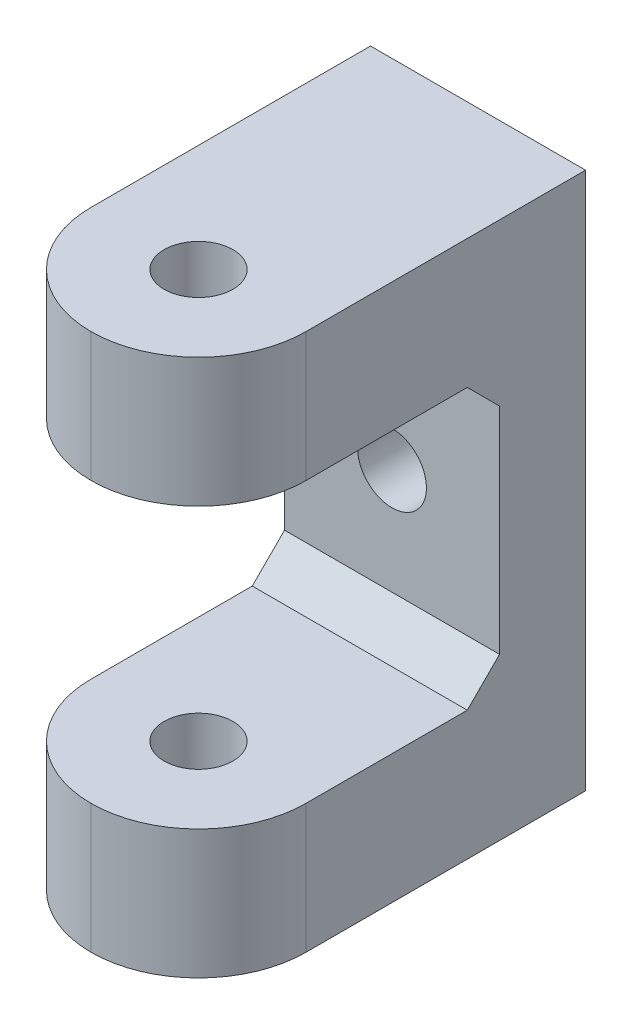
ISO-10303-21;
HEADER;
FILE_DESCRIPTION(('STEP AP214'),'2;1');
FILE_NAME('part.step','',(''),(''),'','','');
FILE_SCHEMA(('AUTOMOTIVE_DESIGN { 1 0 10303 214 1 1 1 1 }'));
ENDSEC;
DATA;
#1=APPLICATION_CONTEXT('core data for automotive mechanical design processes');
#2=APPLICATION_PROTOCOL_DEFINITION('international standard','automotive_design',2000,#1);
#3=PRODUCT_CONTEXT('',#1,'mechanical');
#4=PRODUCT('Part','Part','',(#3));
#5=PRODUCT_RELATED_PRODUCT_CATEGORY('part','',(#4));
#6=PRODUCT_DEFINITION_FORMATION('','',#4);
#7=PRODUCT_DEFINITION_CONTEXT('part definition',#1,'design');
#8=PRODUCT_DEFINITION('design','',#6,#7);
#9=PRODUCT_DEFINITION_SHAPE('','',#8);
#10=(LENGTH_UNIT() NAMED_UNIT(*) SI_UNIT(.MILLI.,.METRE.));
#11=(NAMED_UNIT(*) PLANE_ANGLE_UNIT() SI_UNIT($,.RADIAN.));
#12=(NAMED_UNIT(*) SI_UNIT($,.STERADIAN.) SOLID_ANGLE_UNIT());
#13=UNCERTAINTY_MEASURE_WITH_UNIT(LENGTH_MEASURE(1.E-05),#10,'distance_accuracy_value','');
#14=(GEOMETRIC_REPRESENTATION_CONTEXT(3) GLOBAL_UNCERTAINTY_ASSIGNED_CONTEXT((#13)) GLOBAL_UNIT_ASSIGNED_CONTEXT((#10,
#11,#12)) REPRESENTATION_CONTEXT('',''));
#15=CARTESIAN_POINT('',(0.,0.,0.));
#16=DIRECTION('',(0.,0.,1.));
#17=DIRECTION('',(1.,0.,0.));
#18=AXIS2_PLACEMENT_3D('',#15,#16,#17);
#19=CARTESIAN_POINT('',(0.,0.,1.));
#20=DIRECTION('',(0.,0.,-1.));
#21=DIRECTION('',(-1.,0.,0.));
#22=AXIS2_PLACEMENT_3D('',#19,#20,#21);
#23=PLANE('',#22);
#24=CARTESIAN_POINT('',(5.,12.5,1.));
#25=DIRECTION('',(0.,0.,-1.));
#26=DIRECTION('',(-1.,0.,0.));
#27=AXIS2_PLACEMENT_3D('',#24,#25,#26);
#28=CIRCLE('',#27,1.6);
#29=CARTESIAN_POINT('',(3.4,12.5,1.));
#30=VERTEX_POINT('',#29);
#31=EDGE_CURVE('E430',#30,#30,#28,.F.);
#32=ORIENTED_EDGE('',*,*,#31,.F.);
#33=EDGE_LOOP('',(#32));
#34=FACE_BOUND('',#33,.T.);
#35=DIRECTION('',(0.,1.,0.));
#36=VECTOR('',#35,1.);
#37=CARTESIAN_POINT('',(0.,25.,1.));
#38=LINE('',#37,#36);
#39=CARTESIAN_POINT('',(0.,7.50000000000001,1.));
#40=VERTEX_POINT('',#39);
#41=CARTESIAN_POINT('',(0.,17.5,1.));
#42=VERTEX_POINT('',#41);
#43=EDGE_CURVE('E142',#40,#42,#38,.T.);
#44=ORIENTED_EDGE('',*,*,#43,.F.);
#45=DIRECTION('',(1.,0.,0.));
#46=VECTOR('',#45,1.);
#47=CARTESIAN_POINT('',(10.,7.50000000000001,1.));
#48=LINE('',#47,#46);
#49=CARTESIAN_POINT('',(10.,7.50000000000001,1.));
#50=VERTEX_POINT('',#49);
#51=EDGE_CURVE('E217',#40,#50,#48,.T.);
#52=ORIENTED_EDGE('',*,*,#51,.T.);
#53=DIRECTION('',(0.,-1.,0.));
#54=VECTOR('',#53,1.);
#55=CARTESIAN_POINT('',(10.,25.,1.));
#56=LINE('',#55,#54);
#57=CARTESIAN_POINT('',(10.,17.5,1.));
#58=VERTEX_POINT('',#57);
#59=EDGE_CURVE('E181',#58,#50,#56,.T.);
#60=ORIENTED_EDGE('',*,*,#59,.F.);
#61=DIRECTION('',(-1.,0.,0.));
#62=VECTOR('',#61,1.);
#63=CARTESIAN_POINT('',(0.,17.5,1.));
#64=LINE('',#63,#62);
#65=EDGE_CURVE('E209',#58,#42,#64,.T.);
#66=ORIENTED_EDGE('',*,*,#65,.T.);
#67=EDGE_LOOP('',(#44,#52,#60,#66));
#68=FACE_BOUND('',#67,.T.);
#69=ADVANCED_FACE('F41',(#34,#68),#23,.F.);
#70=CARTESIAN_POINT('',(0.,6.,15.));
#71=DIRECTION('',(0.,-1.,0.));
#72=DIRECTION('',(0.,0.,-1.));
#73=AXIS2_PLACEMENT_3D('',#70,#71,#72);
#74=PLANE('',#73);
#75=CARTESIAN_POINT('',(5.,6.,10.));
#76=DIRECTION('',(0.,-1.,0.));
#77=DIRECTION('',(0.,0.,-1.));
#78=AXIS2_PLACEMENT_3D('',#75,#76,#77);
#79=CIRCLE('',#78,1.6);
#80=CARTESIAN_POINT('',(5.,6.,8.4));
#81=VERTEX_POINT('',#80);
#82=EDGE_CURVE('E172',#81,#81,#79,.T.);
#83=ORIENTED_EDGE('',*,*,#82,.T.);
#84=EDGE_LOOP('',(#83));
#85=FACE_BOUND('',#84,.T.);
#86=DIRECTION('',(0.,0.,-1.));
#87=VECTOR('',#86,1.);
#88=CARTESIAN_POINT('',(10.,6.,15.));
#89=LINE('',#88,#87);
#90=CARTESIAN_POINT('',(10.,6.,10.));
#91=VERTEX_POINT('',#90);
#92=CARTESIAN_POINT('',(10.,6.,2.5));
#93=VERTEX_POINT('',#92);
#94=EDGE_CURVE('E189',#91,#93,#89,.T.);
#95=ORIENTED_EDGE('',*,*,#94,.T.);
#96=DIRECTION('',(-1.,0.,0.));
#97=VECTOR('',#96,1.);
#98=CARTESIAN_POINT('',(0.,6.,2.5));
#99=LINE('',#98,#97);
#100=CARTESIAN_POINT('',(0.,6.,2.5));
#101=VERTEX_POINT('',#100);
#102=EDGE_CURVE('E220',#93,#101,#99,.T.);
#103=ORIENTED_EDGE('',*,*,#102,.T.);
#104=DIRECTION('',(0.,0.,-1.));
#105=VECTOR('',#104,1.);
#106=CARTESIAN_POINT('',(0.,6.,15.));
#107=LINE('',#106,#105);
#108=CARTESIAN_POINT('',(0.,6.,10.));
#109=VERTEX_POINT('',#108);
#110=EDGE_CURVE('E187',#109,#101,#107,.T.);
#111=ORIENTED_EDGE('',*,*,#110,.F.);
#112=CARTESIAN_POINT('',(5.,6.,10.));
#113=DIRECTION('',(0.,-1.,0.));
#114=DIRECTION('',(0.,0.,-1.));
#115=AXIS2_PLACEMENT_3D('',#112,#113,#114);
#116=CIRCLE('',#115,5.);
#117=CARTESIAN_POINT('',(5.,6.,15.));
#118=VERTEX_POINT('',#117);
#119=EDGE_CURVE('E196',#109,#118,#116,.F.);
#120=ORIENTED_EDGE('',*,*,#119,.T.);
#121=CARTESIAN_POINT('',(5.,6.,10.));
#122=DIRECTION('',(0.,-1.,0.));
#123=DIRECTION('',(0.,0.,-1.));
#124=AXIS2_PLACEMENT_3D('',#121,#122,#123);
#125=CIRCLE('',#124,5.);
#126=EDGE_CURVE('E198',#118,#91,#125,.F.);
#127=ORIENTED_EDGE('',*,*,#126,.T.);
#128=EDGE_LOOP('',(#95,#103,#111,#120,#127));
#129=FACE_BOUND('',#128,.T.);
#130=ADVANCED_FACE('F259',(#85,#129),#74,.F.);
#131=CARTESIAN_POINT('',(0.,0.,15.));
#132=DIRECTION('',(1.,0.,0.));
#133=DIRECTION('',(0.,0.,-1.));
#134=AXIS2_PLACEMENT_3D('',#131,#132,#133);
#135=PLANE('',#134);
#136=ORIENTED_EDGE('',*,*,#110,.T.);
#137=DIRECTION('',(0.,-0.707106781186551,0.707106781186544));
#138=VECTOR('',#137,1.);
#139=CARTESIAN_POINT('',(0.,-3.25000000000003,11.7499999999999));
#140=LINE('',#139,#138);
#141=EDGE_CURVE('E226',#101,#40,#140,.F.);
#142=ORIENTED_EDGE('',*,*,#141,.T.);
#143=ORIENTED_EDGE('',*,*,#43,.T.);
#144=DIRECTION('',(0.,-0.707106781186543,-0.707106781186552));
#145=VECTOR('',#144,1.);
#146=CARTESIAN_POINT('',(0.,15.7500000000001,-0.749999999999917));
#147=LINE('',#146,#145);
#148=CARTESIAN_POINT('',(0.,19.,2.50000000000002));
#149=VERTEX_POINT('',#148);
#150=EDGE_CURVE('E11',#42,#149,#147,.F.);
#151=ORIENTED_EDGE('',*,*,#150,.T.);
#152=DIRECTION('',(0.,0.,-1.));
#153=VECTOR('',#152,1.);
#154=CARTESIAN_POINT('',(0.,19.,15.));
#155=LINE('',#154,#153);
#156=CARTESIAN_POINT('',(0.,19.,10.));
#157=VERTEX_POINT('',#156);
#158=EDGE_CURVE('E148',#157,#149,#155,.T.);
#159=ORIENTED_EDGE('',*,*,#158,.F.);
#160=DIRECTION('',(0.,-1.,0.));
#161=VECTOR('',#160,1.);
#162=CARTESIAN_POINT('',(0.,19.,10.));
#163=LINE('',#162,#161);
#164=CARTESIAN_POINT('',(0.,25.,10.));
#165=VERTEX_POINT('',#164);
#166=EDGE_CURVE('E145',#157,#165,#163,.F.);
#167=ORIENTED_EDGE('',*,*,#166,.T.);
#168=DIRECTION('',(0.,0.,-1.));
#169=VECTOR('',#168,1.);
#170=CARTESIAN_POINT('',(0.,25.,1.));
#171=LINE('',#170,#169);
#172=CARTESIAN_POINT('',(0.,25.,-3.));
#173=VERTEX_POINT('',#172);
#174=EDGE_CURVE('E130',#165,#173,#171,.T.);
#175=ORIENTED_EDGE('',*,*,#174,.T.);
#176=DIRECTION('',(0.,1.,0.));
#177=VECTOR('',#176,1.);
#178=CARTESIAN_POINT('',(0.,25.,-3.));
#179=LINE('',#178,#177);
#180=CARTESIAN_POINT('',(0.,0.,-3.));
#181=VERTEX_POINT('',#180);
#182=EDGE_CURVE('E178',#181,#173,#179,.T.);
#183=ORIENTED_EDGE('',*,*,#182,.F.);
#184=DIRECTION('',(0.,0.,-1.));
#185=VECTOR('',#184,1.);
#186=CARTESIAN_POINT('',(0.,0.,15.));
#187=LINE('',#186,#185);
#188=CARTESIAN_POINT('',(0.,0.,10.));
#189=VERTEX_POINT('',#188);
#190=EDGE_CURVE('E194',#189,#181,#187,.T.);
#191=ORIENTED_EDGE('',*,*,#190,.F.);
#192=DIRECTION('',(0.,-1.,0.));
#193=VECTOR('',#192,1.);
#194=CARTESIAN_POINT('',(0.,0.,10.));
#195=LINE('',#194,#193);
#196=EDGE_CURVE('E207',#189,#109,#195,.F.);
#197=ORIENTED_EDGE('',*,*,#196,.T.);
#198=EDGE_LOOP('',(#136,#142,#143,#151,#159,#167,#175,#183,#191,#197));
#199=FACE_BOUND('',#198,.T.);
#200=ADVANCED_FACE('F147',(#199),#135,.F.);
#201=CARTESIAN_POINT('',(0.,0.,15.));
#202=DIRECTION('',(0.,1.,0.));
#203=DIRECTION('',(0.,0.,1.));
#204=AXIS2_PLACEMENT_3D('',#201,#202,#203);
#205=PLANE('',#204);
#206=CARTESIAN_POINT('',(5.,0.,10.));
#207=DIRECTION('',(0.,1.,0.));
#208=DIRECTION('',(0.,0.,1.));
#209=AXIS2_PLACEMENT_3D('',#206,#207,#208);
#210=CIRCLE('',#209,1.6);
#211=CARTESIAN_POINT('',(5.,0.,11.6));
#212=VERTEX_POINT('',#211);
#213=EDGE_CURVE('E215',#212,#212,#210,.T.);
#214=ORIENTED_EDGE('',*,*,#213,.T.);
#215=EDGE_LOOP('',(#214));
#216=FACE_BOUND('',#215,.T.);
#217=DIRECTION('',(-1.,0.,0.));
#218=VECTOR('',#217,1.);
#219=CARTESIAN_POINT('',(10.,0.,-3.));
#220=LINE('',#219,#218);
#221=CARTESIAN_POINT('',(10.,0.,-3.));
#222=VERTEX_POINT('',#221);
#223=EDGE_CURVE('E175',#222,#181,#220,.T.);
#224=ORIENTED_EDGE('',*,*,#223,.F.);
#225=DIRECTION('',(0.,0.,-1.));
#226=VECTOR('',#225,1.);
#227=CARTESIAN_POINT('',(10.,0.,15.));
#228=LINE('',#227,#226);
#229=CARTESIAN_POINT('',(10.,0.,10.));
#230=VERTEX_POINT('',#229);
#231=EDGE_CURVE('E192',#230,#222,#228,.T.);
#232=ORIENTED_EDGE('',*,*,#231,.F.);
#233=CARTESIAN_POINT('',(5.,0.,10.));
#234=DIRECTION('',(0.,1.,0.));
#235=DIRECTION('',(0.,0.,1.));
#236=AXIS2_PLACEMENT_3D('',#233,#234,#235);
#237=CIRCLE('',#236,5.);
#238=CARTESIAN_POINT('',(5.,0.,15.));
#239=VERTEX_POINT('',#238);
#240=EDGE_CURVE('E205',#230,#239,#237,.F.);
#241=ORIENTED_EDGE('',*,*,#240,.T.);
#242=CARTESIAN_POINT('',(5.,0.,10.));
#243=DIRECTION('',(0.,1.,0.));
#244=DIRECTION('',(0.,0.,1.));
#245=AXIS2_PLACEMENT_3D('',#242,#243,#244);
#246=CIRCLE('',#245,5.);
#247=EDGE_CURVE('E203',#239,#189,#246,.F.);
#248=ORIENTED_EDGE('',*,*,#247,.T.);
#249=ORIENTED_EDGE('',*,*,#190,.T.);
#250=EDGE_LOOP('',(#224,#232,#241,#248,#249));
#251=FACE_BOUND('',#250,.T.);
#252=ADVANCED_FACE('F248',(#216,#251),#205,.F.);
#253=CARTESIAN_POINT('',(10.,0.,15.));
#254=DIRECTION('',(-1.,0.,0.));
#255=DIRECTION('',(0.,0.,1.));
#256=AXIS2_PLACEMENT_3D('',#253,#254,#255);
#257=PLANE('',#256);
#258=DIRECTION('',(0.,0.,-1.));
#259=VECTOR('',#258,1.);
#260=CARTESIAN_POINT('',(10.,25.,1.));
#261=LINE('',#260,#259);
#262=CARTESIAN_POINT('',(10.,25.,10.));
#263=VERTEX_POINT('',#262);
#264=CARTESIAN_POINT('',(10.,25.,-3.));
#265=VERTEX_POINT('',#264);
#266=EDGE_CURVE('E141',#263,#265,#261,.T.);
#267=ORIENTED_EDGE('',*,*,#266,.F.);
#268=DIRECTION('',(0.,1.,0.));
#269=VECTOR('',#268,1.);
#270=CARTESIAN_POINT('',(10.,19.,10.));
#271=LINE('',#270,#269);
#272=CARTESIAN_POINT('',(10.,19.,10.));
#273=VERTEX_POINT('',#272);
#274=EDGE_CURVE('E160',#263,#273,#271,.F.);
#275=ORIENTED_EDGE('',*,*,#274,.T.);
#276=DIRECTION('',(0.,0.,-1.));
#277=VECTOR('',#276,1.);
#278=CARTESIAN_POINT('',(10.,19.,15.));
#279=LINE('',#278,#277);
#280=CARTESIAN_POINT('',(10.,19.,2.50000000000002));
#281=VERTEX_POINT('',#280);
#282=EDGE_CURVE('E162',#273,#281,#279,.T.);
#283=ORIENTED_EDGE('',*,*,#282,.T.);
#284=DIRECTION('',(0.,0.707106781186543,0.707106781186552));
#285=VECTOR('',#284,1.);
#286=CARTESIAN_POINT('',(10.,15.7500000000001,-0.749999999999917));
#287=LINE('',#286,#285);
#288=EDGE_CURVE('E50',#281,#58,#287,.F.);
#289=ORIENTED_EDGE('',*,*,#288,.T.);
#290=ORIENTED_EDGE('',*,*,#59,.T.);
#291=DIRECTION('',(0.,0.707106781186551,-0.707106781186544));
#292=VECTOR('',#291,1.);
#293=CARTESIAN_POINT('',(10.,-3.25000000000003,11.7499999999999));
#294=LINE('',#293,#292);
#295=EDGE_CURVE('E224',#50,#93,#294,.F.);
#296=ORIENTED_EDGE('',*,*,#295,.T.);
#297=ORIENTED_EDGE('',*,*,#94,.F.);
#298=DIRECTION('',(0.,1.,0.));
#299=VECTOR('',#298,1.);
#300=CARTESIAN_POINT('',(10.,0.,10.));
#301=LINE('',#300,#299);
#302=EDGE_CURVE('E200',#91,#230,#301,.F.);
#303=ORIENTED_EDGE('',*,*,#302,.T.);
#304=ORIENTED_EDGE('',*,*,#231,.T.);
#305=DIRECTION('',(0.,-1.,0.));
#306=VECTOR('',#305,1.);
#307=CARTESIAN_POINT('',(10.,25.,-3.));
#308=LINE('',#307,#306);
#309=EDGE_CURVE('E151',#265,#222,#308,.T.);
#310=ORIENTED_EDGE('',*,*,#309,.F.);
#311=EDGE_LOOP('',(#267,#275,#283,#289,#290,#296,#297,#303,#304,#310));
#312=FACE_BOUND('',#311,.T.);
#313=ADVANCED_FACE('F230',(#312),#257,.F.);
#314=CARTESIAN_POINT('',(5.,0.,10.));
#315=DIRECTION('',(0.,-1.,0.));
#316=DIRECTION('',(0.,0.,-1.));
#317=AXIS2_PLACEMENT_3D('',#314,#315,#316);
#318=CYLINDRICAL_SURFACE('',#317,5.);
#319=ORIENTED_EDGE('',*,*,#196,.F.);
#320=ORIENTED_EDGE('',*,*,#247,.F.);
#321=DIRECTION('',(0.,-1.,0.));
#322=VECTOR('',#321,1.);
#323=CARTESIAN_POINT('',(5.,0.,15.));
#324=LINE('',#323,#322);
#325=EDGE_CURVE('E185',#118,#239,#324,.T.);
#326=ORIENTED_EDGE('',*,*,#325,.F.);
#327=ORIENTED_EDGE('',*,*,#119,.F.);
#328=EDGE_LOOP('',(#319,#320,#326,#327));
#329=FACE_BOUND('',#328,.T.);
#330=ADVANCED_FACE('F255',(#329),#318,.T.);
#331=CARTESIAN_POINT('',(5.,0.,10.));
#332=DIRECTION('',(0.,1.,0.));
#333=DIRECTION('',(0.,0.,1.));
#334=AXIS2_PLACEMENT_3D('',#331,#332,#333);
#335=CYLINDRICAL_SURFACE('',#334,5.);
#336=ORIENTED_EDGE('',*,*,#240,.F.);
#337=ORIENTED_EDGE('',*,*,#302,.F.);
#338=ORIENTED_EDGE('',*,*,#126,.F.);
#339=ORIENTED_EDGE('',*,*,#325,.T.);
#340=EDGE_LOOP('',(#336,#337,#338,#339));
#341=FACE_BOUND('',#340,.T.);
#342=ADVANCED_FACE('F265',(#341),#335,.T.);
#343=CARTESIAN_POINT('',(10.,25.,1.));
#344=DIRECTION('',(0.,1.,0.));
#345=DIRECTION('',(0.,0.,1.));
#346=AXIS2_PLACEMENT_3D('',#343,#344,#345);
#347=PLANE('',#346);
#348=CARTESIAN_POINT('',(5.,25.,10.));
#349=DIRECTION('',(0.,1.,0.));
#350=DIRECTION('',(0.,0.,1.));
#351=AXIS2_PLACEMENT_3D('',#348,#349,#350);
#352=CIRCLE('',#351,1.6);
#353=CARTESIAN_POINT('',(5.,25.,11.6));
#354=VERTEX_POINT('',#353);
#355=EDGE_CURVE('E433',#354,#354,#352,.T.);
#356=ORIENTED_EDGE('',*,*,#355,.F.);
#357=EDGE_LOOP('',(#356));
#358=FACE_BOUND('',#357,.T.);
#359=DIRECTION('',(1.,0.,0.));
#360=VECTOR('',#359,1.);
#361=CARTESIAN_POINT('',(10.,25.,-3.));
#362=LINE('',#361,#360);
#363=EDGE_CURVE('E138',#173,#265,#362,.T.);
#364=ORIENTED_EDGE('',*,*,#363,.F.);
#365=ORIENTED_EDGE('',*,*,#174,.F.);
#366=CARTESIAN_POINT('',(5.,25.,10.));
#367=DIRECTION('',(0.,-1.,0.));
#368=DIRECTION('',(0.,0.,-1.));
#369=AXIS2_PLACEMENT_3D('',#366,#367,#368);
#370=CIRCLE('',#369,5.);
#371=CARTESIAN_POINT('',(5.,25.,15.));
#372=VERTEX_POINT('',#371);
#373=EDGE_CURVE('E135',#165,#372,#370,.F.);
#374=ORIENTED_EDGE('',*,*,#373,.T.);
#375=CARTESIAN_POINT('',(5.,25.,10.));
#376=DIRECTION('',(0.,-1.,0.));
#377=DIRECTION('',(0.,0.,-1.));
#378=AXIS2_PLACEMENT_3D('',#375,#376,#377);
#379=CIRCLE('',#378,5.);
#380=EDGE_CURVE('E158',#372,#263,#379,.F.);
#381=ORIENTED_EDGE('',*,*,#380,.T.);
#382=ORIENTED_EDGE('',*,*,#266,.T.);
#383=EDGE_LOOP('',(#364,#365,#374,#381,#382));
#384=FACE_BOUND('',#383,.T.);
#385=ADVANCED_FACE('F132',(#358,#384),#347,.T.);
#386=CARTESIAN_POINT('',(0.,0.,-3.));
#387=DIRECTION('',(0.,0.,-1.));
#388=DIRECTION('',(-1.,0.,0.));
#389=AXIS2_PLACEMENT_3D('',#386,#387,#388);
#390=PLANE('',#389);
#391=CARTESIAN_POINT('',(5.,12.5,-3.));
#392=DIRECTION('',(0.,0.,-1.));
#393=DIRECTION('',(-1.,0.,0.));
#394=AXIS2_PLACEMENT_3D('',#391,#392,#393);
#395=CIRCLE('',#394,1.6);
#396=CARTESIAN_POINT('',(3.4,12.5,-3.));
#397=VERTEX_POINT('',#396);
#398=EDGE_CURVE('E429',#397,#397,#395,.T.);
#399=ORIENTED_EDGE('',*,*,#398,.F.);
#400=EDGE_LOOP('',(#399));
#401=FACE_BOUND('',#400,.T.);
#402=ORIENTED_EDGE('',*,*,#309,.T.);
#403=ORIENTED_EDGE('',*,*,#223,.T.);
#404=ORIENTED_EDGE('',*,*,#182,.T.);
#405=ORIENTED_EDGE('',*,*,#363,.T.);
#406=EDGE_LOOP('',(#402,#403,#404,#405));
#407=FACE_BOUND('',#406,.T.);
#408=ADVANCED_FACE('F242',(#401,#407),#390,.T.);
#409=CARTESIAN_POINT('',(0.,19.,15.));
#410=DIRECTION('',(0.,1.,0.));
#411=DIRECTION('',(0.,0.,1.));
#412=AXIS2_PLACEMENT_3D('',#409,#410,#411);
#413=PLANE('',#412);
#414=CARTESIAN_POINT('',(5.,19.,10.));
#415=DIRECTION('',(0.,1.,0.));
#416=DIRECTION('',(0.,0.,1.));
#417=AXIS2_PLACEMENT_3D('',#414,#415,#416);
#418=CIRCLE('',#417,1.6);
#419=CARTESIAN_POINT('',(5.,19.,11.6));
#420=VERTEX_POINT('',#419);
#421=EDGE_CURVE('E212',#420,#420,#418,.T.);
#422=ORIENTED_EDGE('',*,*,#421,.T.);
#423=EDGE_LOOP('',(#422));
#424=FACE_BOUND('',#423,.T.);
#425=ORIENTED_EDGE('',*,*,#158,.T.);
#426=DIRECTION('',(1.,0.,0.));
#427=VECTOR('',#426,1.);
#428=CARTESIAN_POINT('',(10.,19.,2.50000000000002));
#429=LINE('',#428,#427);
#430=EDGE_CURVE('E222',#149,#281,#429,.T.);
#431=ORIENTED_EDGE('',*,*,#430,.T.);
#432=ORIENTED_EDGE('',*,*,#282,.F.);
#433=CARTESIAN_POINT('',(5.,19.,10.));
#434=DIRECTION('',(0.,1.,0.));
#435=DIRECTION('',(0.,0.,1.));
#436=AXIS2_PLACEMENT_3D('',#433,#434,#435);
#437=CIRCLE('',#436,5.);
#438=CARTESIAN_POINT('',(5.,19.,15.));
#439=VERTEX_POINT('',#438);
#440=EDGE_CURVE('E152',#273,#439,#437,.F.);
#441=ORIENTED_EDGE('',*,*,#440,.T.);
#442=CARTESIAN_POINT('',(5.,19.,10.));
#443=DIRECTION('',(0.,1.,0.));
#444=DIRECTION('',(0.,0.,1.));
#445=AXIS2_PLACEMENT_3D('',#442,#443,#444);
#446=CIRCLE('',#445,5.);
#447=EDGE_CURVE('E168',#439,#157,#446,.F.);
#448=ORIENTED_EDGE('',*,*,#447,.T.);
#449=EDGE_LOOP('',(#425,#431,#432,#441,#448));
#450=FACE_BOUND('',#449,.T.);
#451=ADVANCED_FACE('F236',(#424,#450),#413,.F.);
#452=CARTESIAN_POINT('',(5.,0.,10.));
#453=DIRECTION('',(0.,-1.,0.));
#454=DIRECTION('',(0.,0.,-1.));
#455=AXIS2_PLACEMENT_3D('',#452,#453,#454);
#456=CYLINDRICAL_SURFACE('',#455,5.);
#457=ORIENTED_EDGE('',*,*,#166,.F.);
#458=ORIENTED_EDGE('',*,*,#447,.F.);
#459=DIRECTION('',(0.,-1.,0.));
#460=VECTOR('',#459,1.);
#461=CARTESIAN_POINT('',(5.,0.,15.));
#462=LINE('',#461,#460);
#463=EDGE_CURVE('E156',#372,#439,#462,.T.);
#464=ORIENTED_EDGE('',*,*,#463,.F.);
#465=ORIENTED_EDGE('',*,*,#373,.F.);
#466=EDGE_LOOP('',(#457,#458,#464,#465));
#467=FACE_BOUND('',#466,.T.);
#468=ADVANCED_FACE('F154',(#467),#456,.T.);
#469=CARTESIAN_POINT('',(5.,0.,10.));
#470=DIRECTION('',(0.,1.,0.));
#471=DIRECTION('',(0.,0.,1.));
#472=AXIS2_PLACEMENT_3D('',#469,#470,#471);
#473=CYLINDRICAL_SURFACE('',#472,5.);
#474=ORIENTED_EDGE('',*,*,#440,.F.);
#475=ORIENTED_EDGE('',*,*,#274,.F.);
#476=ORIENTED_EDGE('',*,*,#380,.F.);
#477=ORIENTED_EDGE('',*,*,#463,.T.);
#478=EDGE_LOOP('',(#474,#475,#476,#477));
#479=FACE_BOUND('',#478,.T.);
#480=ADVANCED_FACE('F238',(#479),#473,.T.);
#481=CARTESIAN_POINT('',(5.,0.,10.));
#482=DIRECTION('',(0.,1.,0.));
#483=DIRECTION('',(0.,0.,1.));
#484=AXIS2_PLACEMENT_3D('',#481,#482,#483);
#485=CYLINDRICAL_SURFACE('',#484,1.6);
#486=ORIENTED_EDGE('',*,*,#355,.T.);
#487=EDGE_LOOP('',(#486));
#488=FACE_BOUND('',#487,.T.);
#489=ORIENTED_EDGE('',*,*,#421,.F.);
#490=EDGE_LOOP('',(#489));
#491=FACE_BOUND('',#490,.T.);
#492=ADVANCED_FACE('F340',(#488,#491),#485,.F.);
#493=ORIENTED_EDGE('',*,*,#213,.F.);
#494=EDGE_LOOP('',(#493));
#495=FACE_BOUND('',#494,.T.);
#496=ORIENTED_EDGE('',*,*,#82,.F.);
#497=EDGE_LOOP('',(#496));
#498=FACE_BOUND('',#497,.T.);
#499=ADVANCED_FACE('F332',(#495,#498),#485,.F.);
#500=CARTESIAN_POINT('',(5.,12.5,15.001));
#501=DIRECTION('',(0.,0.,-1.));
#502=DIRECTION('',(-1.,0.,0.));
#503=AXIS2_PLACEMENT_3D('',#500,#501,#502);
#504=CYLINDRICAL_SURFACE('',#503,1.6);
#505=ORIENTED_EDGE('',*,*,#398,.T.);
#506=EDGE_LOOP('',(#505));
#507=FACE_BOUND('',#506,.T.);
#508=ORIENTED_EDGE('',*,*,#31,.T.);
#509=EDGE_LOOP('',(#508));
#510=FACE_BOUND('',#509,.T.);
#511=ADVANCED_FACE('F318',(#507,#510),#504,.F.);
#512=CARTESIAN_POINT('',(0.,7.50000000000001,1.));
#513=DIRECTION('',(0.,0.707106781186544,0.707106781186551));
#514=DIRECTION('',(-1.,0.,0.));
#515=AXIS2_PLACEMENT_3D('',#512,#513,#514);
#516=PLANE('',#515);
#517=ORIENTED_EDGE('',*,*,#141,.F.);
#518=ORIENTED_EDGE('',*,*,#102,.F.);
#519=ORIENTED_EDGE('',*,*,#295,.F.);
#520=ORIENTED_EDGE('',*,*,#51,.F.);
#521=EDGE_LOOP('',(#517,#518,#519,#520));
#522=FACE_BOUND('',#521,.T.);
#523=ADVANCED_FACE('F263',(#522),#516,.T.);
#524=CARTESIAN_POINT('',(0.,19.,2.50000000000002));
#525=DIRECTION('',(0.,-0.707106781186552,0.707106781186543));
#526=DIRECTION('',(-1.,0.,0.));
#527=AXIS2_PLACEMENT_3D('',#524,#525,#526);
#528=PLANE('',#527);
#529=ORIENTED_EDGE('',*,*,#150,.F.);
#530=ORIENTED_EDGE('',*,*,#65,.F.);
#531=ORIENTED_EDGE('',*,*,#288,.F.);
#532=ORIENTED_EDGE('',*,*,#430,.F.);
#533=EDGE_LOOP('',(#529,#530,#531,#532));
#534=FACE_BOUND('',#533,.T.);
#535=ADVANCED_FACE('F44',(#534),#528,.T.);
#536=CLOSED_SHELL('',(#69,#130,#200,#252,#313,#330,#342,#385,#408,#451,#468,#480,#492,#499,#511,
#523,#535));
#537=MANIFOLD_SOLID_BREP('B2',#536);
#538=ADVANCED_BREP_SHAPE_REPRESENTATION('',(#18,#537),#14);
#539=SHAPE_DEFINITION_REPRESENTATION(#9,#538);
ENDSEC;
END-ISO-10303-21;
